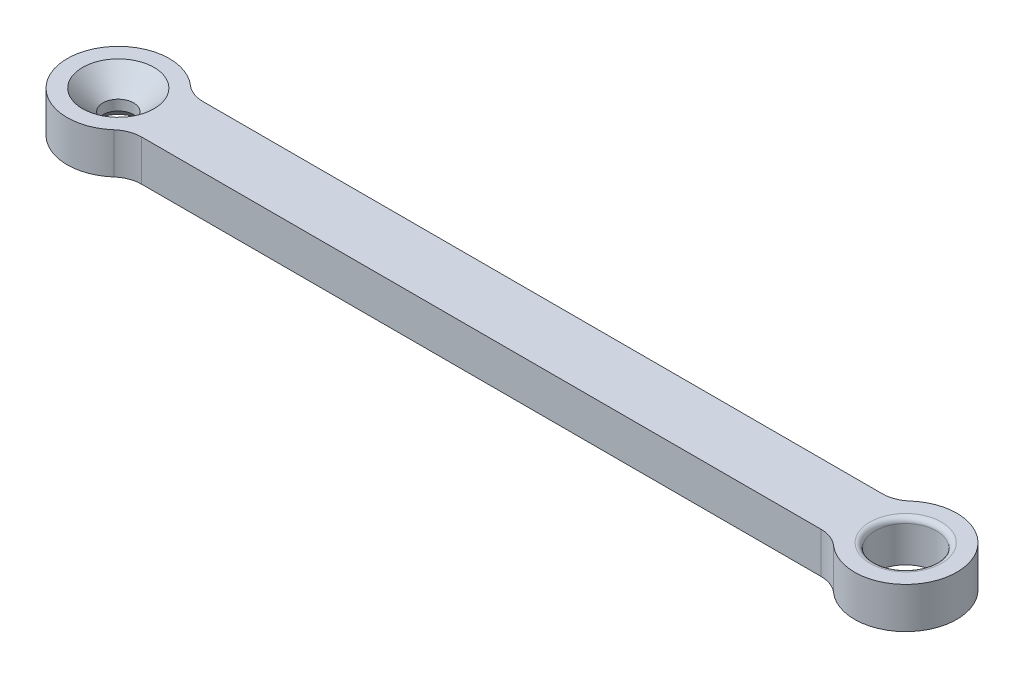
ISO-10303-21;
HEADER;
FILE_DESCRIPTION(('STEP AP214'),'2;1');
FILE_NAME('part.step','',(''),(''),'','','');
FILE_SCHEMA(('AUTOMOTIVE_DESIGN { 1 0 10303 214 1 1 1 1 }'));
ENDSEC;
DATA;
#1=APPLICATION_CONTEXT('core data for automotive mechanical design processes');
#2=APPLICATION_PROTOCOL_DEFINITION('international standard','automotive_design',2000,#1);
#3=PRODUCT_CONTEXT('',#1,'mechanical');
#4=PRODUCT('Part','Part','',(#3));
#5=PRODUCT_RELATED_PRODUCT_CATEGORY('part','',(#4));
#6=PRODUCT_DEFINITION_FORMATION('','',#4);
#7=PRODUCT_DEFINITION_CONTEXT('part definition',#1,'design');
#8=PRODUCT_DEFINITION('design','',#6,#7);
#9=PRODUCT_DEFINITION_SHAPE('','',#8);
#10=(LENGTH_UNIT() NAMED_UNIT(*) SI_UNIT(.MILLI.,.METRE.));
#11=(NAMED_UNIT(*) PLANE_ANGLE_UNIT() SI_UNIT($,.RADIAN.));
#12=(NAMED_UNIT(*) SI_UNIT($,.STERADIAN.) SOLID_ANGLE_UNIT());
#13=UNCERTAINTY_MEASURE_WITH_UNIT(LENGTH_MEASURE(1.E-05),#10,'distance_accuracy_value','');
#14=(GEOMETRIC_REPRESENTATION_CONTEXT(3) GLOBAL_UNCERTAINTY_ASSIGNED_CONTEXT((#13)) GLOBAL_UNIT_ASSIGNED_CONTEXT((#10,
#11,#12)) REPRESENTATION_CONTEXT('',''));
#15=CARTESIAN_POINT('',(0.,0.,0.));
#16=DIRECTION('',(0.,0.,1.));
#17=DIRECTION('',(1.,0.,0.));
#18=AXIS2_PLACEMENT_3D('',#15,#16,#17);
#19=CARTESIAN_POINT('',(-38.5,4.,0.));
#20=DIRECTION('',(0.,-1.,0.));
#21=DIRECTION('',(0.,0.,-1.));
#22=AXIS2_PLACEMENT_3D('',#19,#20,#21);
#23=CYLINDRICAL_SURFACE('',#22,5.);
#24=CARTESIAN_POINT('',(-38.5,0.,0.));
#25=DIRECTION('',(0.,-1.,0.));
#26=DIRECTION('',(0.,0.,-1.));
#27=AXIS2_PLACEMENT_3D('',#24,#25,#26);
#28=CIRCLE('',#27,5.);
#29=CARTESIAN_POINT('',(-35.1928108611693,0.,3.75));
#30=VERTEX_POINT('',#29);
#31=CARTESIAN_POINT('',(-35.1928108611693,0.,-3.75));
#32=VERTEX_POINT('',#31);
#33=EDGE_CURVE('E305',#30,#32,#28,.T.);
#34=ORIENTED_EDGE('',*,*,#33,.F.);
#35=DIRECTION('',(0.,-1.,0.));
#36=VECTOR('',#35,1.);
#37=CARTESIAN_POINT('',(-35.1928108611693,4.,3.75));
#38=LINE('',#37,#36);
#39=CARTESIAN_POINT('',(-35.1928108611693,4.,3.75));
#40=VERTEX_POINT('',#39);
#41=EDGE_CURVE('E152',#30,#40,#38,.F.);
#42=ORIENTED_EDGE('',*,*,#41,.T.);
#43=CARTESIAN_POINT('',(-38.5,4.,0.));
#44=DIRECTION('',(0.,-1.,0.));
#45=DIRECTION('',(0.,0.,-1.));
#46=AXIS2_PLACEMENT_3D('',#43,#44,#45);
#47=CIRCLE('',#46,5.);
#48=CARTESIAN_POINT('',(-35.1928108611693,4.,-3.75));
#49=VERTEX_POINT('',#48);
#50=EDGE_CURVE('E124',#40,#49,#47,.T.);
#51=ORIENTED_EDGE('',*,*,#50,.T.);
#52=DIRECTION('',(0.,-1.,0.));
#53=VECTOR('',#52,1.);
#54=CARTESIAN_POINT('',(-35.1928108611693,4.,-3.75));
#55=LINE('',#54,#53);
#56=EDGE_CURVE('E147',#49,#32,#55,.T.);
#57=ORIENTED_EDGE('',*,*,#56,.T.);
#58=EDGE_LOOP('',(#34,#42,#51,#57));
#59=FACE_BOUND('',#58,.T.);
#60=ADVANCED_FACE('F51',(#59),#23,.T.);
#61=CARTESIAN_POINT('',(-33.2084973778708,4.,-6.));
#62=DIRECTION('',(0.,-1.,0.));
#63=DIRECTION('',(0.,0.,-1.));
#64=AXIS2_PLACEMENT_3D('',#61,#62,#63);
#65=CYLINDRICAL_SURFACE('',#64,3.);
#66=CARTESIAN_POINT('',(-33.2084973778708,4.,-6.));
#67=DIRECTION('',(0.,1.,0.));
#68=DIRECTION('',(0.,0.,1.));
#69=AXIS2_PLACEMENT_3D('',#66,#67,#68);
#70=CIRCLE('',#69,3.);
#71=CARTESIAN_POINT('',(-33.2084973778708,4.,-3.));
#72=VERTEX_POINT('',#71);
#73=EDGE_CURVE('E167',#72,#49,#70,.F.);
#74=ORIENTED_EDGE('',*,*,#73,.F.);
#75=DIRECTION('',(0.,1.,0.));
#76=VECTOR('',#75,1.);
#77=CARTESIAN_POINT('',(-33.2084973778708,4.,-3.));
#78=LINE('',#77,#76);
#79=CARTESIAN_POINT('',(-33.2084973778708,0.,-3.));
#80=VERTEX_POINT('',#79);
#81=EDGE_CURVE('E160',#80,#72,#78,.T.);
#82=ORIENTED_EDGE('',*,*,#81,.F.);
#83=CARTESIAN_POINT('',(-33.2084973778708,0.,-6.));
#84=DIRECTION('',(0.,1.,0.));
#85=DIRECTION('',(0.,0.,1.));
#86=AXIS2_PLACEMENT_3D('',#83,#84,#85);
#87=CIRCLE('',#86,3.);
#88=EDGE_CURVE('E129',#32,#80,#87,.T.);
#89=ORIENTED_EDGE('',*,*,#88,.F.);
#90=ORIENTED_EDGE('',*,*,#56,.F.);
#91=EDGE_LOOP('',(#74,#82,#89,#90));
#92=FACE_BOUND('',#91,.T.);
#93=ADVANCED_FACE('F241',(#92),#65,.F.);
#94=CARTESIAN_POINT('',(-33.2084973778708,4.,6.));
#95=DIRECTION('',(0.,-1.,0.));
#96=DIRECTION('',(0.,0.,-1.));
#97=AXIS2_PLACEMENT_3D('',#94,#95,#96);
#98=CYLINDRICAL_SURFACE('',#97,3.);
#99=CARTESIAN_POINT('',(-33.2084973778708,4.,6.));
#100=DIRECTION('',(0.,1.,0.));
#101=DIRECTION('',(0.,0.,1.));
#102=AXIS2_PLACEMENT_3D('',#99,#100,#101);
#103=CIRCLE('',#102,3.);
#104=CARTESIAN_POINT('',(-33.2084973778708,4.,3.));
#105=VERTEX_POINT('',#104);
#106=EDGE_CURVE('E119',#40,#105,#103,.F.);
#107=ORIENTED_EDGE('',*,*,#106,.F.);
#108=ORIENTED_EDGE('',*,*,#41,.F.);
#109=CARTESIAN_POINT('',(-33.2084973778708,0.,6.));
#110=DIRECTION('',(0.,1.,0.));
#111=DIRECTION('',(0.,0.,1.));
#112=AXIS2_PLACEMENT_3D('',#109,#110,#111);
#113=CIRCLE('',#112,3.);
#114=CARTESIAN_POINT('',(-33.2084973778708,0.,3.));
#115=VERTEX_POINT('',#114);
#116=EDGE_CURVE('E130',#115,#30,#113,.T.);
#117=ORIENTED_EDGE('',*,*,#116,.F.);
#118=DIRECTION('',(0.,-1.,0.));
#119=VECTOR('',#118,1.);
#120=CARTESIAN_POINT('',(-33.2084973778708,4.,3.));
#121=LINE('',#120,#119);
#122=EDGE_CURVE('E137',#105,#115,#121,.T.);
#123=ORIENTED_EDGE('',*,*,#122,.F.);
#124=EDGE_LOOP('',(#107,#108,#117,#123));
#125=FACE_BOUND('',#124,.T.);
#126=ADVANCED_FACE('F145',(#125),#98,.F.);
#127=CARTESIAN_POINT('',(0.,4.,0.));
#128=DIRECTION('',(0.,1.,0.));
#129=DIRECTION('',(0.,0.,1.));
#130=AXIS2_PLACEMENT_3D('',#127,#128,#129);
#131=PLANE('',#130);
#132=CARTESIAN_POINT('',(38.5,4.,0.));
#133=DIRECTION('',(0.,1.,0.));
#134=DIRECTION('',(0.,0.,1.));
#135=AXIS2_PLACEMENT_3D('',#132,#133,#134);
#136=CIRCLE('',#135,3.5);
#137=CARTESIAN_POINT('',(38.5,4.,3.5));
#138=VERTEX_POINT('',#137);
#139=EDGE_CURVE('E13',#138,#138,#136,.F.);
#140=ORIENTED_EDGE('',*,*,#139,.T.);
#141=EDGE_LOOP('',(#140));
#142=FACE_BOUND('',#141,.T.);
#143=CARTESIAN_POINT('',(-38.5,4.,0.));
#144=DIRECTION('',(0.,1.,0.));
#145=DIRECTION('',(0.,0.,1.));
#146=AXIS2_PLACEMENT_3D('',#143,#144,#145);
#147=CIRCLE('',#146,3.5);
#148=CARTESIAN_POINT('',(-38.5,4.,3.5));
#149=VERTEX_POINT('',#148);
#150=EDGE_CURVE('E196',#149,#149,#147,.F.);
#151=ORIENTED_EDGE('',*,*,#150,.T.);
#152=EDGE_LOOP('',(#151));
#153=FACE_BOUND('',#152,.T.);
#154=DIRECTION('',(1.,0.,0.));
#155=VECTOR('',#154,1.);
#156=CARTESIAN_POINT('',(-34.9379464036872,4.,3.));
#157=LINE('',#156,#155);
#158=CARTESIAN_POINT('',(33.2084973778708,4.,3.));
#159=VERTEX_POINT('',#158);
#160=EDGE_CURVE('E122',#105,#159,#157,.T.);
#161=ORIENTED_EDGE('',*,*,#160,.T.);
#162=CARTESIAN_POINT('',(33.2084973778708,4.,6.));
#163=DIRECTION('',(0.,1.,0.));
#164=DIRECTION('',(0.,0.,1.));
#165=AXIS2_PLACEMENT_3D('',#162,#163,#164);
#166=CIRCLE('',#165,3.);
#167=CARTESIAN_POINT('',(35.1928108611693,4.,3.75));
#168=VERTEX_POINT('',#167);
#169=EDGE_CURVE('E181',#159,#168,#166,.F.);
#170=ORIENTED_EDGE('',*,*,#169,.T.);
#171=CARTESIAN_POINT('',(38.5,4.,0.));
#172=DIRECTION('',(0.,-1.,0.));
#173=DIRECTION('',(0.,0.,-1.));
#174=AXIS2_PLACEMENT_3D('',#171,#172,#173);
#175=CIRCLE('',#174,5.);
#176=CARTESIAN_POINT('',(35.1928108611693,4.,-3.75));
#177=VERTEX_POINT('',#176);
#178=EDGE_CURVE('E295',#177,#168,#175,.T.);
#179=ORIENTED_EDGE('',*,*,#178,.F.);
#180=CARTESIAN_POINT('',(33.2084973778708,4.,-6.));
#181=DIRECTION('',(0.,1.,0.));
#182=DIRECTION('',(0.,0.,1.));
#183=AXIS2_PLACEMENT_3D('',#180,#181,#182);
#184=CIRCLE('',#183,3.);
#185=CARTESIAN_POINT('',(33.2084973778708,4.,-3.));
#186=VERTEX_POINT('',#185);
#187=EDGE_CURVE('E67',#177,#186,#184,.F.);
#188=ORIENTED_EDGE('',*,*,#187,.T.);
#189=DIRECTION('',(1.,0.,0.));
#190=VECTOR('',#189,1.);
#191=CARTESIAN_POINT('',(-34.9379464036872,4.,-3.));
#192=LINE('',#191,#190);
#193=EDGE_CURVE('E142',#72,#186,#192,.T.);
#194=ORIENTED_EDGE('',*,*,#193,.F.);
#195=ORIENTED_EDGE('',*,*,#73,.T.);
#196=ORIENTED_EDGE('',*,*,#50,.F.);
#197=ORIENTED_EDGE('',*,*,#106,.T.);
#198=EDGE_LOOP('',(#161,#170,#179,#188,#194,#195,#196,#197));
#199=FACE_BOUND('',#198,.T.);
#200=ADVANCED_FACE('F121',(#142,#153,#199),#131,.T.);
#201=CARTESIAN_POINT('',(0.,0.,0.));
#202=DIRECTION('',(0.,1.,0.));
#203=DIRECTION('',(0.,0.,1.));
#204=AXIS2_PLACEMENT_3D('',#201,#202,#203);
#205=PLANE('',#204);
#206=CARTESIAN_POINT('',(-38.5,0.,0.));
#207=DIRECTION('',(0.,1.,0.));
#208=DIRECTION('',(0.,0.,1.));
#209=AXIS2_PLACEMENT_3D('',#206,#207,#208);
#210=CIRCLE('',#209,2.5);
#211=CARTESIAN_POINT('',(-38.5,0.,2.5));
#212=VERTEX_POINT('',#211);
#213=EDGE_CURVE('E200',#212,#212,#210,.T.);
#214=ORIENTED_EDGE('',*,*,#213,.T.);
#215=EDGE_LOOP('',(#214));
#216=FACE_BOUND('',#215,.T.);
#217=CARTESIAN_POINT('',(38.5,0.,0.));
#218=DIRECTION('',(0.,1.,0.));
#219=DIRECTION('',(0.,0.,1.));
#220=AXIS2_PLACEMENT_3D('',#217,#218,#219);
#221=CIRCLE('',#220,3.);
#222=CARTESIAN_POINT('',(38.5,0.,3.));
#223=VERTEX_POINT('',#222);
#224=EDGE_CURVE('E285',#223,#223,#221,.T.);
#225=ORIENTED_EDGE('',*,*,#224,.T.);
#226=EDGE_LOOP('',(#225));
#227=FACE_BOUND('',#226,.T.);
#228=DIRECTION('',(1.,0.,0.));
#229=VECTOR('',#228,1.);
#230=CARTESIAN_POINT('',(-34.9379464036872,0.,-3.));
#231=LINE('',#230,#229);
#232=CARTESIAN_POINT('',(33.2084973778708,0.,-3.));
#233=VERTEX_POINT('',#232);
#234=EDGE_CURVE('E143',#80,#233,#231,.T.);
#235=ORIENTED_EDGE('',*,*,#234,.T.);
#236=CARTESIAN_POINT('',(33.2084973778708,0.,-6.));
#237=DIRECTION('',(0.,1.,0.));
#238=DIRECTION('',(0.,0.,1.));
#239=AXIS2_PLACEMENT_3D('',#236,#237,#238);
#240=CIRCLE('',#239,3.);
#241=CARTESIAN_POINT('',(35.1928108611693,0.,-3.75));
#242=VERTEX_POINT('',#241);
#243=EDGE_CURVE('E189',#233,#242,#240,.T.);
#244=ORIENTED_EDGE('',*,*,#243,.T.);
#245=CARTESIAN_POINT('',(38.5,0.,0.));
#246=DIRECTION('',(0.,-1.,0.));
#247=DIRECTION('',(0.,0.,-1.));
#248=AXIS2_PLACEMENT_3D('',#245,#246,#247);
#249=CIRCLE('',#248,5.);
#250=CARTESIAN_POINT('',(35.1928108611693,0.,3.75));
#251=VERTEX_POINT('',#250);
#252=EDGE_CURVE('E297',#242,#251,#249,.T.);
#253=ORIENTED_EDGE('',*,*,#252,.T.);
#254=CARTESIAN_POINT('',(33.2084973778708,0.,6.));
#255=DIRECTION('',(0.,1.,0.));
#256=DIRECTION('',(0.,0.,1.));
#257=AXIS2_PLACEMENT_3D('',#254,#255,#256);
#258=CIRCLE('',#257,3.);
#259=CARTESIAN_POINT('',(33.2084973778708,0.,3.));
#260=VERTEX_POINT('',#259);
#261=EDGE_CURVE('E184',#251,#260,#258,.T.);
#262=ORIENTED_EDGE('',*,*,#261,.T.);
#263=DIRECTION('',(1.,0.,0.));
#264=VECTOR('',#263,1.);
#265=CARTESIAN_POINT('',(-34.9379464036872,0.,3.));
#266=LINE('',#265,#264);
#267=EDGE_CURVE('E292',#115,#260,#266,.T.);
#268=ORIENTED_EDGE('',*,*,#267,.F.);
#269=ORIENTED_EDGE('',*,*,#116,.T.);
#270=ORIENTED_EDGE('',*,*,#33,.T.);
#271=ORIENTED_EDGE('',*,*,#88,.T.);
#272=EDGE_LOOP('',(#235,#244,#253,#262,#268,#269,#270,#271));
#273=FACE_BOUND('',#272,.T.);
#274=ADVANCED_FACE('F234',(#216,#227,#273),#205,.F.);
#275=CARTESIAN_POINT('',(-34.9379464036872,4.,3.));
#276=DIRECTION('',(0.,0.,-1.));
#277=DIRECTION('',(-1.,0.,0.));
#278=AXIS2_PLACEMENT_3D('',#275,#276,#277);
#279=PLANE('',#278);
#280=ORIENTED_EDGE('',*,*,#267,.T.);
#281=DIRECTION('',(0.,-1.,0.));
#282=VECTOR('',#281,1.);
#283=CARTESIAN_POINT('',(33.2084973778708,4.,3.));
#284=LINE('',#283,#282);
#285=EDGE_CURVE('E140',#260,#159,#284,.F.);
#286=ORIENTED_EDGE('',*,*,#285,.T.);
#287=ORIENTED_EDGE('',*,*,#160,.F.);
#288=ORIENTED_EDGE('',*,*,#122,.T.);
#289=EDGE_LOOP('',(#280,#286,#287,#288));
#290=FACE_BOUND('',#289,.T.);
#291=ADVANCED_FACE('F136',(#290),#279,.F.);
#292=CARTESIAN_POINT('',(-34.9379464036872,4.,-3.));
#293=DIRECTION('',(0.,0.,-1.));
#294=DIRECTION('',(-1.,0.,0.));
#295=AXIS2_PLACEMENT_3D('',#292,#293,#294);
#296=PLANE('',#295);
#297=ORIENTED_EDGE('',*,*,#193,.T.);
#298=DIRECTION('',(0.,1.,0.));
#299=VECTOR('',#298,1.);
#300=CARTESIAN_POINT('',(33.2084973778708,0.,-3.));
#301=LINE('',#300,#299);
#302=EDGE_CURVE('E74',#186,#233,#301,.F.);
#303=ORIENTED_EDGE('',*,*,#302,.T.);
#304=ORIENTED_EDGE('',*,*,#234,.F.);
#305=ORIENTED_EDGE('',*,*,#81,.T.);
#306=EDGE_LOOP('',(#297,#303,#304,#305));
#307=FACE_BOUND('',#306,.T.);
#308=ADVANCED_FACE('F223',(#307),#296,.T.);
#309=CARTESIAN_POINT('',(38.5,4.,0.));
#310=DIRECTION('',(0.,-1.,0.));
#311=DIRECTION('',(0.,0.,-1.));
#312=AXIS2_PLACEMENT_3D('',#309,#310,#311);
#313=CYLINDRICAL_SURFACE('',#312,5.);
#314=ORIENTED_EDGE('',*,*,#178,.T.);
#315=DIRECTION('',(0.,-1.,0.));
#316=VECTOR('',#315,1.);
#317=CARTESIAN_POINT('',(35.1928108611693,4.,3.75));
#318=LINE('',#317,#316);
#319=EDGE_CURVE('E176',#168,#251,#318,.T.);
#320=ORIENTED_EDGE('',*,*,#319,.T.);
#321=ORIENTED_EDGE('',*,*,#252,.F.);
#322=DIRECTION('',(0.,-1.,0.));
#323=VECTOR('',#322,1.);
#324=CARTESIAN_POINT('',(35.1928108611693,4.,-3.75));
#325=LINE('',#324,#323);
#326=EDGE_CURVE('E172',#242,#177,#325,.F.);
#327=ORIENTED_EDGE('',*,*,#326,.T.);
#328=EDGE_LOOP('',(#314,#320,#321,#327));
#329=FACE_BOUND('',#328,.T.);
#330=ADVANCED_FACE('F225',(#329),#313,.T.);
#331=CARTESIAN_POINT('',(33.2084973778708,4.,6.));
#332=DIRECTION('',(0.,-1.,0.));
#333=DIRECTION('',(0.,0.,-1.));
#334=AXIS2_PLACEMENT_3D('',#331,#332,#333);
#335=CYLINDRICAL_SURFACE('',#334,3.);
#336=ORIENTED_EDGE('',*,*,#261,.F.);
#337=ORIENTED_EDGE('',*,*,#319,.F.);
#338=ORIENTED_EDGE('',*,*,#169,.F.);
#339=ORIENTED_EDGE('',*,*,#285,.F.);
#340=EDGE_LOOP('',(#336,#337,#338,#339));
#341=FACE_BOUND('',#340,.T.);
#342=ADVANCED_FACE('F231',(#341),#335,.F.);
#343=CARTESIAN_POINT('',(33.2084973778708,4.,-6.));
#344=DIRECTION('',(0.,-1.,0.));
#345=DIRECTION('',(0.,0.,-1.));
#346=AXIS2_PLACEMENT_3D('',#343,#344,#345);
#347=CYLINDRICAL_SURFACE('',#346,3.);
#348=ORIENTED_EDGE('',*,*,#243,.F.);
#349=ORIENTED_EDGE('',*,*,#302,.F.);
#350=ORIENTED_EDGE('',*,*,#187,.F.);
#351=ORIENTED_EDGE('',*,*,#326,.F.);
#352=EDGE_LOOP('',(#348,#349,#350,#351));
#353=FACE_BOUND('',#352,.T.);
#354=ADVANCED_FACE('F247',(#353),#347,.F.);
#355=CARTESIAN_POINT('',(-38.5,4.,0.));
#356=DIRECTION('',(0.,1.,0.));
#357=DIRECTION('',(0.,0.,1.));
#358=AXIS2_PLACEMENT_3D('',#355,#356,#357);
#359=CYLINDRICAL_SURFACE('',#358,1.49999999999999);
#360=CARTESIAN_POINT('',(-38.5,1.,0.));
#361=DIRECTION('',(0.,1.,0.));
#362=DIRECTION('',(0.,0.,1.));
#363=AXIS2_PLACEMENT_3D('',#360,#361,#362);
#364=CIRCLE('',#363,1.49999999999999);
#365=CARTESIAN_POINT('',(-38.5,1.,1.49999999999999));
#366=VERTEX_POINT('',#365);
#367=EDGE_CURVE('E204',#366,#366,#364,.F.);
#368=ORIENTED_EDGE('',*,*,#367,.T.);
#369=EDGE_LOOP('',(#368));
#370=FACE_BOUND('',#369,.T.);
#371=CARTESIAN_POINT('',(-38.5,2.,0.));
#372=DIRECTION('',(0.,1.,0.));
#373=DIRECTION('',(0.,0.,1.));
#374=AXIS2_PLACEMENT_3D('',#371,#372,#373);
#375=CIRCLE('',#374,1.49999999999999);
#376=CARTESIAN_POINT('',(-38.5,2.,1.49999999999999));
#377=VERTEX_POINT('',#376);
#378=EDGE_CURVE('E192',#377,#377,#375,.T.);
#379=ORIENTED_EDGE('',*,*,#378,.T.);
#380=EDGE_LOOP('',(#379));
#381=FACE_BOUND('',#380,.T.);
#382=ADVANCED_FACE('F251',(#370,#381),#359,.F.);
#383=CARTESIAN_POINT('',(38.5,4.,0.));
#384=DIRECTION('',(0.,1.,0.));
#385=DIRECTION('',(0.,0.,1.));
#386=AXIS2_PLACEMENT_3D('',#383,#384,#385);
#387=CYLINDRICAL_SURFACE('',#386,3.);
#388=CARTESIAN_POINT('',(38.5,3.5,0.));
#389=DIRECTION('',(0.,1.,0.));
#390=DIRECTION('',(0.,0.,1.));
#391=AXIS2_PLACEMENT_3D('',#388,#389,#390);
#392=CIRCLE('',#391,3.);
#393=CARTESIAN_POINT('',(38.5,3.5,3.));
#394=VERTEX_POINT('',#393);
#395=EDGE_CURVE('E60',#394,#394,#392,.T.);
#396=ORIENTED_EDGE('',*,*,#395,.T.);
#397=EDGE_LOOP('',(#396));
#398=FACE_BOUND('',#397,.T.);
#399=ORIENTED_EDGE('',*,*,#224,.F.);
#400=EDGE_LOOP('',(#399));
#401=FACE_BOUND('',#400,.T.);
#402=ADVANCED_FACE('F211',(#398,#401),#387,.F.);
#403=CARTESIAN_POINT('',(-38.5,2.,0.));
#404=DIRECTION('',(0.,1.,0.));
#405=DIRECTION('',(0.,0.,1.));
#406=AXIS2_PLACEMENT_3D('',#403,#404,#405);
#407=CONICAL_SURFACE('',#406,1.49999999999999,0.78539816339745);
#408=ORIENTED_EDGE('',*,*,#150,.F.);
#409=EDGE_LOOP('',(#408));
#410=FACE_BOUND('',#409,.T.);
#411=ORIENTED_EDGE('',*,*,#378,.F.);
#412=EDGE_LOOP('',(#411));
#413=FACE_BOUND('',#412,.T.);
#414=ADVANCED_FACE('F220',(#410,#413),#407,.F.);
#415=CARTESIAN_POINT('',(-38.5,0.,0.));
#416=DIRECTION('',(0.,-1.,0.));
#417=DIRECTION('',(0.,0.,-1.));
#418=AXIS2_PLACEMENT_3D('',#415,#416,#417);
#419=CONICAL_SURFACE('',#418,2.5,0.785398163397451);
#420=ORIENTED_EDGE('',*,*,#367,.F.);
#421=EDGE_LOOP('',(#420));
#422=FACE_BOUND('',#421,.T.);
#423=ORIENTED_EDGE('',*,*,#213,.F.);
#424=EDGE_LOOP('',(#423));
#425=FACE_BOUND('',#424,.T.);
#426=ADVANCED_FACE('F215',(#422,#425),#419,.F.);
#427=CARTESIAN_POINT('',(38.5,3.5,0.));
#428=DIRECTION('',(0.,1.,0.));
#429=DIRECTION('',(0.,0.,1.));
#430=AXIS2_PLACEMENT_3D('',#427,#428,#429);
#431=TOROIDAL_SURFACE('',#430,3.5,0.5);
#432=ORIENTED_EDGE('',*,*,#139,.F.);
#433=EDGE_LOOP('',(#432));
#434=FACE_BOUND('',#433,.T.);
#435=ORIENTED_EDGE('',*,*,#395,.F.);
#436=EDGE_LOOP('',(#435));
#437=FACE_BOUND('',#436,.T.);
#438=ADVANCED_FACE('F53',(#434,#437),#431,.T.);
#439=CLOSED_SHELL('',(#60,#93,#126,#200,#274,#291,#308,#330,#342,#354,#382,#402,#414,#426,#438));
#440=MANIFOLD_SOLID_BREP('B2',#439);
#441=ADVANCED_BREP_SHAPE_REPRESENTATION('',(#18,#440),#14);
#442=SHAPE_DEFINITION_REPRESENTATION(#9,#441);
ENDSEC;
END-ISO-10303-21;
